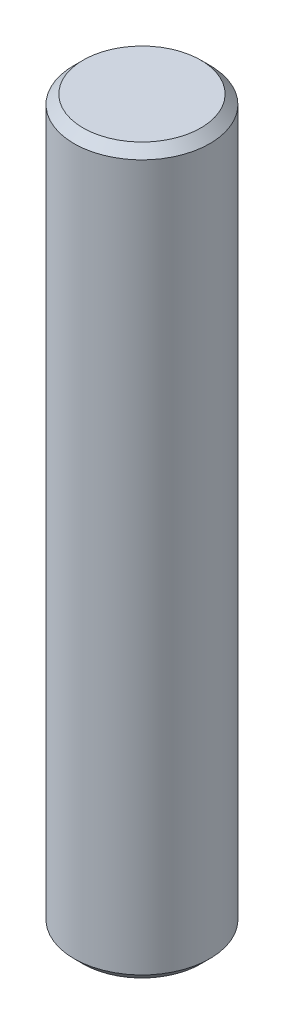
ISO-10303-21;
HEADER;
FILE_DESCRIPTION(('STEP AP214'),'2;1');
FILE_NAME('part.step','',(''),(''),'','','');
FILE_SCHEMA(('AUTOMOTIVE_DESIGN { 1 0 10303 214 1 1 1 1 }'));
ENDSEC;
DATA;
#1=APPLICATION_CONTEXT('core data for automotive mechanical design processes');
#2=APPLICATION_PROTOCOL_DEFINITION('international standard','automotive_design',2000,#1);
#3=PRODUCT_CONTEXT('',#1,'mechanical');
#4=PRODUCT('Part','Part','',(#3));
#5=PRODUCT_RELATED_PRODUCT_CATEGORY('part','',(#4));
#6=PRODUCT_DEFINITION_FORMATION('','',#4);
#7=PRODUCT_DEFINITION_CONTEXT('part definition',#1,'design');
#8=PRODUCT_DEFINITION('design','',#6,#7);
#9=PRODUCT_DEFINITION_SHAPE('','',#8);
#10=(LENGTH_UNIT() NAMED_UNIT(*) SI_UNIT(.MILLI.,.METRE.));
#11=(NAMED_UNIT(*) PLANE_ANGLE_UNIT() SI_UNIT($,.RADIAN.));
#12=(NAMED_UNIT(*) SI_UNIT($,.STERADIAN.) SOLID_ANGLE_UNIT());
#13=UNCERTAINTY_MEASURE_WITH_UNIT(LENGTH_MEASURE(1.E-05),#10,'distance_accuracy_value','');
#14=(GEOMETRIC_REPRESENTATION_CONTEXT(3) GLOBAL_UNCERTAINTY_ASSIGNED_CONTEXT((#13)) GLOBAL_UNIT_ASSIGNED_CONTEXT((#10,
#11,#12)) REPRESENTATION_CONTEXT('',''));
#15=CARTESIAN_POINT('',(0.,0.,0.));
#16=DIRECTION('',(0.,0.,1.));
#17=DIRECTION('',(1.,0.,0.));
#18=AXIS2_PLACEMENT_3D('',#15,#16,#17);
#19=CARTESIAN_POINT('',(0.,16.,0.));
#20=DIRECTION('',(0.,-1.,0.));
#21=DIRECTION('',(0.,0.,-1.));
#22=AXIS2_PLACEMENT_3D('',#19,#20,#21);
#23=CYLINDRICAL_SURFACE('',#22,1.5);
#24=CARTESIAN_POINT('',(0.,15.8,0.));
#25=DIRECTION('',(0.,1.,0.));
#26=DIRECTION('',(0.,0.,1.));
#27=AXIS2_PLACEMENT_3D('',#24,#25,#26);
#28=CIRCLE('',#27,1.5);
#29=CARTESIAN_POINT('',(0.,15.8,1.5));
#30=VERTEX_POINT('',#29);
#31=EDGE_CURVE('E44',#30,#30,#28,.F.);
#32=ORIENTED_EDGE('',*,*,#31,.T.);
#33=EDGE_LOOP('',(#32));
#34=FACE_BOUND('',#33,.T.);
#35=CARTESIAN_POINT('',(0.,0.200000000000002,0.));
#36=DIRECTION('',(0.,1.,0.));
#37=DIRECTION('',(0.,0.,1.));
#38=AXIS2_PLACEMENT_3D('',#35,#36,#37);
#39=CIRCLE('',#38,1.5);
#40=CARTESIAN_POINT('',(0.,0.200000000000002,1.5));
#41=VERTEX_POINT('',#40);
#42=EDGE_CURVE('E48',#41,#41,#39,.T.);
#43=ORIENTED_EDGE('',*,*,#42,.T.);
#44=EDGE_LOOP('',(#43));
#45=FACE_BOUND('',#44,.T.);
#46=ADVANCED_FACE('F36',(#34,#45),#23,.T.);
#47=CARTESIAN_POINT('',(0.,16.,0.));
#48=DIRECTION('',(0.,1.,0.));
#49=DIRECTION('',(0.,0.,1.));
#50=AXIS2_PLACEMENT_3D('',#47,#48,#49);
#51=PLANE('',#50);
#52=CARTESIAN_POINT('',(0.,16.,0.));
#53=DIRECTION('',(0.,1.,0.));
#54=DIRECTION('',(0.,0.,1.));
#55=AXIS2_PLACEMENT_3D('',#52,#53,#54);
#56=CIRCLE('',#55,1.3);
#57=CARTESIAN_POINT('',(0.,16.,1.3));
#58=VERTEX_POINT('',#57);
#59=EDGE_CURVE('E52',#58,#58,#56,.T.);
#60=ORIENTED_EDGE('',*,*,#59,.T.);
#61=EDGE_LOOP('',(#60));
#62=FACE_BOUND('',#61,.T.);
#63=ADVANCED_FACE('F58',(#62),#51,.T.);
#64=CARTESIAN_POINT('',(0.,0.,0.));
#65=DIRECTION('',(0.,1.,0.));
#66=DIRECTION('',(0.,0.,1.));
#67=AXIS2_PLACEMENT_3D('',#64,#65,#66);
#68=PLANE('',#67);
#69=CARTESIAN_POINT('',(0.,0.,0.));
#70=DIRECTION('',(0.,1.,0.));
#71=DIRECTION('',(0.,0.,1.));
#72=AXIS2_PLACEMENT_3D('',#69,#70,#71);
#73=CIRCLE('',#72,1.3);
#74=CARTESIAN_POINT('',(0.,0.,1.3));
#75=VERTEX_POINT('',#74);
#76=EDGE_CURVE('E10',#75,#75,#73,.F.);
#77=ORIENTED_EDGE('',*,*,#76,.T.);
#78=EDGE_LOOP('',(#77));
#79=FACE_BOUND('',#78,.T.);
#80=ADVANCED_FACE('F62',(#79),#68,.F.);
#81=CARTESIAN_POINT('',(0.,16.,0.));
#82=DIRECTION('',(0.,-1.,0.));
#83=DIRECTION('',(0.,0.,-1.));
#84=AXIS2_PLACEMENT_3D('',#81,#82,#83);
#85=CONICAL_SURFACE('',#84,1.3,0.785398163397446);
#86=ORIENTED_EDGE('',*,*,#31,.F.);
#87=EDGE_LOOP('',(#86));
#88=FACE_BOUND('',#87,.T.);
#89=ORIENTED_EDGE('',*,*,#59,.F.);
#90=EDGE_LOOP('',(#89));
#91=FACE_BOUND('',#90,.T.);
#92=ADVANCED_FACE('F60',(#88,#91),#85,.T.);
#93=CARTESIAN_POINT('',(0.,0.200000000000002,0.));
#94=DIRECTION('',(0.,1.,0.));
#95=DIRECTION('',(0.,0.,1.));
#96=AXIS2_PLACEMENT_3D('',#93,#94,#95);
#97=CONICAL_SURFACE('',#96,1.5,0.785398163397445);
#98=ORIENTED_EDGE('',*,*,#76,.F.);
#99=EDGE_LOOP('',(#98));
#100=FACE_BOUND('',#99,.T.);
#101=ORIENTED_EDGE('',*,*,#42,.F.);
#102=EDGE_LOOP('',(#101));
#103=FACE_BOUND('',#102,.T.);
#104=ADVANCED_FACE('F39',(#100,#103),#97,.T.);
#105=CLOSED_SHELL('',(#46,#63,#80,#92,#104));
#106=MANIFOLD_SOLID_BREP('B2',#105);
#107=ADVANCED_BREP_SHAPE_REPRESENTATION('',(#18,#106),#14);
#108=SHAPE_DEFINITION_REPRESENTATION(#9,#107);
ENDSEC;
END-ISO-10303-21;
